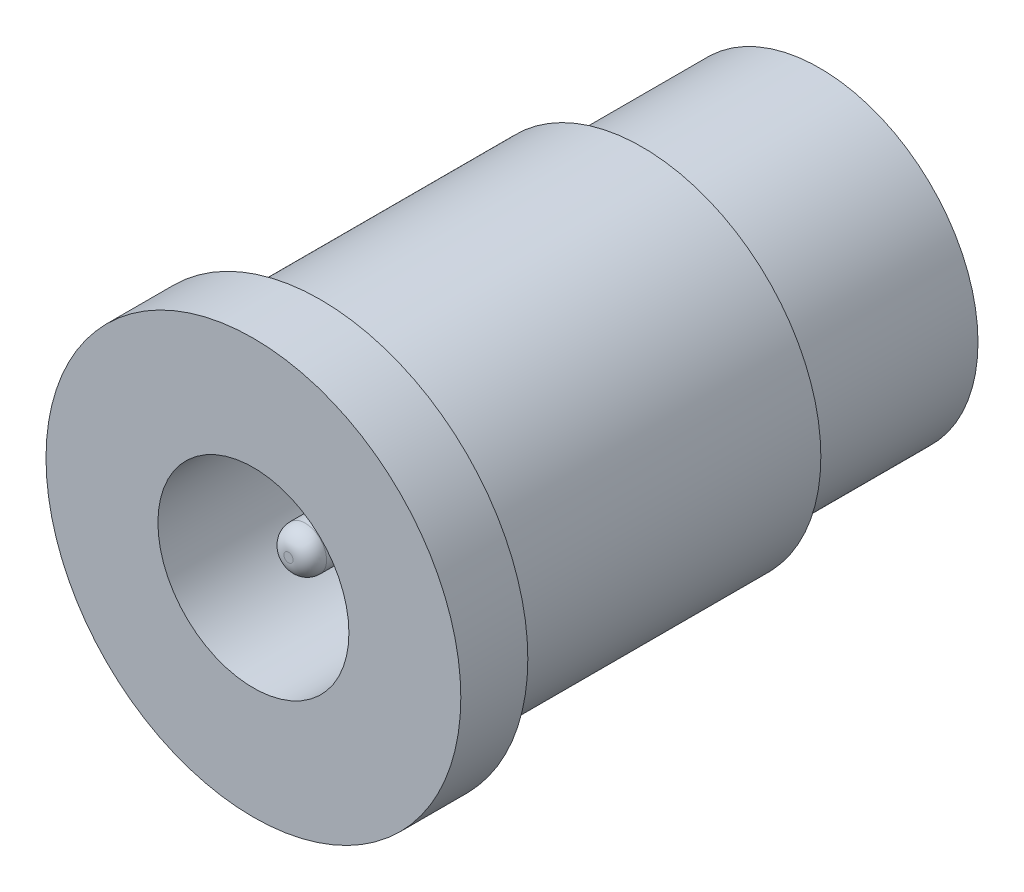
ISO-10303-21;
HEADER;
FILE_DESCRIPTION(('STEP AP214'),'2;1');
FILE_NAME('part.step','',(''),(''),'','','');
FILE_SCHEMA(('AUTOMOTIVE_DESIGN { 1 0 10303 214 1 1 1 1 }'));
ENDSEC;
DATA;
#1=APPLICATION_CONTEXT('core data for automotive mechanical design processes');
#2=APPLICATION_PROTOCOL_DEFINITION('international standard','automotive_design',2000,#1);
#3=PRODUCT_CONTEXT('',#1,'mechanical');
#4=PRODUCT('Part','Part','',(#3));
#5=PRODUCT_RELATED_PRODUCT_CATEGORY('part','',(#4));
#6=PRODUCT_DEFINITION_FORMATION('','',#4);
#7=PRODUCT_DEFINITION_CONTEXT('part definition',#1,'design');
#8=PRODUCT_DEFINITION('design','',#6,#7);
#9=PRODUCT_DEFINITION_SHAPE('','',#8);
#10=(LENGTH_UNIT() NAMED_UNIT(*) SI_UNIT(.MILLI.,.METRE.));
#11=(NAMED_UNIT(*) PLANE_ANGLE_UNIT() SI_UNIT($,.RADIAN.));
#12=(NAMED_UNIT(*) SI_UNIT($,.STERADIAN.) SOLID_ANGLE_UNIT());
#13=UNCERTAINTY_MEASURE_WITH_UNIT(LENGTH_MEASURE(1.E-05),#10,'distance_accuracy_value','');
#14=(GEOMETRIC_REPRESENTATION_CONTEXT(3) GLOBAL_UNCERTAINTY_ASSIGNED_CONTEXT((#13)) GLOBAL_UNIT_ASSIGNED_CONTEXT((#10,
#11,#12)) REPRESENTATION_CONTEXT('',''));
#15=CARTESIAN_POINT('',(0.,0.,0.));
#16=DIRECTION('',(0.,0.,1.));
#17=DIRECTION('',(1.,0.,0.));
#18=AXIS2_PLACEMENT_3D('',#15,#16,#17);
#19=CARTESIAN_POINT('',(0.,0.,5.00661764705883));
#20=DIRECTION('',(0.,0.,1.));
#21=DIRECTION('',(1.,0.,0.));
#22=AXIS2_PLACEMENT_3D('',#19,#20,#21);
#23=CYLINDRICAL_SURFACE('',#22,2.85);
#24=CARTESIAN_POINT('',(0.,0.,-11.6));
#25=DIRECTION('',(0.,0.,1.));
#26=DIRECTION('',(1.,0.,0.));
#27=AXIS2_PLACEMENT_3D('',#24,#25,#26);
#28=CIRCLE('',#27,2.85);
#29=CARTESIAN_POINT('',(2.85,0.,-11.6));
#30=VERTEX_POINT('',#29);
#31=EDGE_CURVE('E68',#30,#30,#28,.T.);
#32=ORIENTED_EDGE('',*,*,#31,.F.);
#33=EDGE_LOOP('',(#32));
#34=FACE_BOUND('',#33,.T.);
#35=CARTESIAN_POINT('',(0.,0.,0.));
#36=DIRECTION('',(0.,0.,1.));
#37=DIRECTION('',(1.,0.,0.));
#38=AXIS2_PLACEMENT_3D('',#35,#36,#37);
#39=CIRCLE('',#38,2.85);
#40=CARTESIAN_POINT('',(2.85,0.,0.));
#41=VERTEX_POINT('',#40);
#42=EDGE_CURVE('E10',#41,#41,#39,.T.);
#43=ORIENTED_EDGE('',*,*,#42,.T.);
#44=EDGE_LOOP('',(#43));
#45=FACE_BOUND('',#44,.T.);
#46=ADVANCED_FACE('F31',(#34,#45),#23,.F.);
#47=CARTESIAN_POINT('',(0.,2.85,0.));
#48=DIRECTION('',(0.,0.,-1.));
#49=DIRECTION('',(-1.,0.,0.));
#50=AXIS2_PLACEMENT_3D('',#47,#48,#49);
#51=PLANE('',#50);
#52=ORIENTED_EDGE('',*,*,#42,.F.);
#53=EDGE_LOOP('',(#52));
#54=FACE_BOUND('',#53,.T.);
#55=CARTESIAN_POINT('',(0.,0.,0.));
#56=DIRECTION('',(0.,0.,1.));
#57=DIRECTION('',(1.,0.,0.));
#58=AXIS2_PLACEMENT_3D('',#55,#56,#57);
#59=CIRCLE('',#58,6.19);
#60=CARTESIAN_POINT('',(6.19,0.,0.));
#61=VERTEX_POINT('',#60);
#62=EDGE_CURVE('E37',#61,#61,#59,.T.);
#63=ORIENTED_EDGE('',*,*,#62,.T.);
#64=EDGE_LOOP('',(#63));
#65=FACE_BOUND('',#64,.T.);
#66=ADVANCED_FACE('F75',(#54,#65),#51,.F.);
#67=CARTESIAN_POINT('',(0.,0.,5.00661764705883));
#68=DIRECTION('',(0.,0.,1.));
#69=DIRECTION('',(1.,0.,0.));
#70=AXIS2_PLACEMENT_3D('',#67,#68,#69);
#71=CYLINDRICAL_SURFACE('',#70,6.19);
#72=ORIENTED_EDGE('',*,*,#62,.F.);
#73=EDGE_LOOP('',(#72));
#74=FACE_BOUND('',#73,.T.);
#75=CARTESIAN_POINT('',(0.,0.,-2.));
#76=DIRECTION('',(0.,0.,1.));
#77=DIRECTION('',(1.,0.,0.));
#78=AXIS2_PLACEMENT_3D('',#75,#76,#77);
#79=CIRCLE('',#78,6.19);
#80=CARTESIAN_POINT('',(6.19,0.,-2.));
#81=VERTEX_POINT('',#80);
#82=EDGE_CURVE('E41',#81,#81,#79,.T.);
#83=ORIENTED_EDGE('',*,*,#82,.T.);
#84=EDGE_LOOP('',(#83));
#85=FACE_BOUND('',#84,.T.);
#86=ADVANCED_FACE('F79',(#74,#85),#71,.T.);
#87=CARTESIAN_POINT('',(0.,6.19,-2.));
#88=DIRECTION('',(0.,0.,1.));
#89=DIRECTION('',(1.,0.,0.));
#90=AXIS2_PLACEMENT_3D('',#87,#88,#89);
#91=PLANE('',#90);
#92=ORIENTED_EDGE('',*,*,#82,.F.);
#93=EDGE_LOOP('',(#92));
#94=FACE_BOUND('',#93,.T.);
#95=CARTESIAN_POINT('',(0.,0.,-2.));
#96=DIRECTION('',(0.,0.,1.));
#97=DIRECTION('',(1.,0.,0.));
#98=AXIS2_PLACEMENT_3D('',#95,#96,#97);
#99=CIRCLE('',#98,5.335);
#100=CARTESIAN_POINT('',(5.335,0.,-2.));
#101=VERTEX_POINT('',#100);
#102=EDGE_CURVE('E45',#101,#101,#99,.T.);
#103=ORIENTED_EDGE('',*,*,#102,.T.);
#104=EDGE_LOOP('',(#103));
#105=FACE_BOUND('',#104,.T.);
#106=ADVANCED_FACE('F84',(#94,#105),#91,.F.);
#107=CARTESIAN_POINT('',(0.,0.,5.00661764705883));
#108=DIRECTION('',(0.,0.,1.));
#109=DIRECTION('',(1.,0.,0.));
#110=AXIS2_PLACEMENT_3D('',#107,#108,#109);
#111=CYLINDRICAL_SURFACE('',#110,5.335);
#112=ORIENTED_EDGE('',*,*,#102,.F.);
#113=EDGE_LOOP('',(#112));
#114=FACE_BOUND('',#113,.T.);
#115=CARTESIAN_POINT('',(0.,0.,-11.6));
#116=DIRECTION('',(0.,0.,1.));
#117=DIRECTION('',(1.,0.,0.));
#118=AXIS2_PLACEMENT_3D('',#115,#116,#117);
#119=CIRCLE('',#118,5.335);
#120=CARTESIAN_POINT('',(5.335,0.,-11.6));
#121=VERTEX_POINT('',#120);
#122=EDGE_CURVE('E50',#121,#121,#119,.T.);
#123=ORIENTED_EDGE('',*,*,#122,.T.);
#124=EDGE_LOOP('',(#123));
#125=FACE_BOUND('',#124,.T.);
#126=ADVANCED_FACE('F90',(#114,#125),#111,.T.);
#127=CARTESIAN_POINT('',(0.,5.335,-11.6));
#128=DIRECTION('',(0.,0.,1.));
#129=DIRECTION('',(1.,0.,0.));
#130=AXIS2_PLACEMENT_3D('',#127,#128,#129);
#131=PLANE('',#130);
#132=ORIENTED_EDGE('',*,*,#122,.F.);
#133=EDGE_LOOP('',(#132));
#134=FACE_BOUND('',#133,.T.);
#135=CARTESIAN_POINT('',(0.,0.,-11.6));
#136=DIRECTION('',(0.,0.,1.));
#137=DIRECTION('',(1.,0.,0.));
#138=AXIS2_PLACEMENT_3D('',#135,#136,#137);
#139=CIRCLE('',#138,4.725);
#140=CARTESIAN_POINT('',(4.725,0.,-11.6));
#141=VERTEX_POINT('',#140);
#142=EDGE_CURVE('E53',#141,#141,#139,.T.);
#143=ORIENTED_EDGE('',*,*,#142,.T.);
#144=EDGE_LOOP('',(#143));
#145=FACE_BOUND('',#144,.T.);
#146=ADVANCED_FACE('F94',(#134,#145),#131,.F.);
#147=CARTESIAN_POINT('',(0.,0.,5.00661764705883));
#148=DIRECTION('',(0.,0.,1.));
#149=DIRECTION('',(1.,0.,0.));
#150=AXIS2_PLACEMENT_3D('',#147,#148,#149);
#151=CYLINDRICAL_SURFACE('',#150,4.725);
#152=ORIENTED_EDGE('',*,*,#142,.F.);
#153=EDGE_LOOP('',(#152));
#154=FACE_BOUND('',#153,.T.);
#155=CARTESIAN_POINT('',(0.,0.,-16.9));
#156=DIRECTION('',(0.,0.,1.));
#157=DIRECTION('',(1.,0.,0.));
#158=AXIS2_PLACEMENT_3D('',#155,#156,#157);
#159=CIRCLE('',#158,4.725);
#160=CARTESIAN_POINT('',(4.725,0.,-16.9));
#161=VERTEX_POINT('',#160);
#162=EDGE_CURVE('E56',#161,#161,#159,.T.);
#163=ORIENTED_EDGE('',*,*,#162,.T.);
#164=EDGE_LOOP('',(#163));
#165=FACE_BOUND('',#164,.T.);
#166=ADVANCED_FACE('F98',(#154,#165),#151,.T.);
#167=CARTESIAN_POINT('',(0.,4.725,-16.9));
#168=DIRECTION('',(0.,0.,1.));
#169=DIRECTION('',(1.,0.,0.));
#170=AXIS2_PLACEMENT_3D('',#167,#168,#169);
#171=PLANE('',#170);
#172=ORIENTED_EDGE('',*,*,#162,.F.);
#173=EDGE_LOOP('',(#172));
#174=FACE_BOUND('',#173,.T.);
#175=ADVANCED_FACE('F102',(#174),#171,.F.);
#176=CARTESIAN_POINT('',(0.,0.,-1.04683823529412));
#177=DIRECTION('',(0.,0.,-1.));
#178=DIRECTION('',(-1.,0.,0.));
#179=AXIS2_PLACEMENT_3D('',#176,#177,#178);
#180=PLANE('',#179);
#181=CARTESIAN_POINT('',(0.,0.,-1.04683823529412));
#182=DIRECTION('',(0.,0.,1.));
#183=DIRECTION('',(1.,0.,0.));
#184=AXIS2_PLACEMENT_3D('',#181,#182,#183);
#185=CIRCLE('',#184,0.137205882352938);
#186=CARTESIAN_POINT('',(0.137205882352938,0.,-1.04683823529412));
#187=VERTEX_POINT('',#186);
#188=EDGE_CURVE('E59',#187,#187,#185,.T.);
#189=ORIENTED_EDGE('',*,*,#188,.T.);
#190=EDGE_LOOP('',(#189));
#191=FACE_BOUND('',#190,.T.);
#192=ADVANCED_FACE('F106',(#191),#180,.F.);
#193=CARTESIAN_POINT('',(0.,0.,-1.54683823529412));
#194=DIRECTION('',(0.,0.,1.));
#195=DIRECTION('',(1.,0.,0.));
#196=AXIS2_PLACEMENT_3D('',#193,#194,#195);
#197=DEGENERATE_TOROIDAL_SURFACE('',#196,0.137205882352941,0.5,.T.);
#198=ORIENTED_EDGE('',*,*,#188,.F.);
#199=EDGE_LOOP('',(#198));
#200=FACE_BOUND('',#199,.T.);
#201=CARTESIAN_POINT('',(0.,0.,-1.54683823529412));
#202=DIRECTION('',(0.,0.,1.));
#203=DIRECTION('',(1.,0.,0.));
#204=AXIS2_PLACEMENT_3D('',#201,#202,#203);
#205=CIRCLE('',#204,0.637205882352941);
#206=CARTESIAN_POINT('',(0.637205882352941,0.,-1.54683823529412));
#207=VERTEX_POINT('',#206);
#208=EDGE_CURVE('E62',#207,#207,#205,.T.);
#209=ORIENTED_EDGE('',*,*,#208,.T.);
#210=EDGE_LOOP('',(#209));
#211=FACE_BOUND('',#210,.T.);
#212=ADVANCED_FACE('F110',(#200,#211),#197,.T.);
#213=CARTESIAN_POINT('',(0.,0.,5.00661764705883));
#214=DIRECTION('',(0.,0.,1.));
#215=DIRECTION('',(1.,0.,0.));
#216=AXIS2_PLACEMENT_3D('',#213,#214,#215);
#217=CYLINDRICAL_SURFACE('',#216,0.637205882352941);
#218=ORIENTED_EDGE('',*,*,#208,.F.);
#219=EDGE_LOOP('',(#218));
#220=FACE_BOUND('',#219,.T.);
#221=CARTESIAN_POINT('',(0.,0.,-11.6));
#222=DIRECTION('',(0.,0.,1.));
#223=DIRECTION('',(1.,0.,0.));
#224=AXIS2_PLACEMENT_3D('',#221,#222,#223);
#225=CIRCLE('',#224,0.637205882352941);
#226=CARTESIAN_POINT('',(0.637205882352941,0.,-11.6));
#227=VERTEX_POINT('',#226);
#228=EDGE_CURVE('E65',#227,#227,#225,.T.);
#229=ORIENTED_EDGE('',*,*,#228,.T.);
#230=EDGE_LOOP('',(#229));
#231=FACE_BOUND('',#230,.T.);
#232=ADVANCED_FACE('F114',(#220,#231),#217,.T.);
#233=CARTESIAN_POINT('',(0.,0.637205882352941,-11.6));
#234=DIRECTION('',(0.,0.,-1.));
#235=DIRECTION('',(-1.,0.,0.));
#236=AXIS2_PLACEMENT_3D('',#233,#234,#235);
#237=PLANE('',#236);
#238=ORIENTED_EDGE('',*,*,#228,.F.);
#239=EDGE_LOOP('',(#238));
#240=FACE_BOUND('',#239,.T.);
#241=ORIENTED_EDGE('',*,*,#31,.T.);
#242=EDGE_LOOP('',(#241));
#243=FACE_BOUND('',#242,.T.);
#244=ADVANCED_FACE('F72',(#240,#243),#237,.F.);
#245=CLOSED_SHELL('',(#46,#66,#86,#106,#126,#146,#166,#175,#192,#212,#232,#244));
#246=MANIFOLD_SOLID_BREP('B2',#245);
#247=ADVANCED_BREP_SHAPE_REPRESENTATION('',(#18,#246),#14);
#248=SHAPE_DEFINITION_REPRESENTATION(#9,#247);
ENDSEC;
END-ISO-10303-21;
